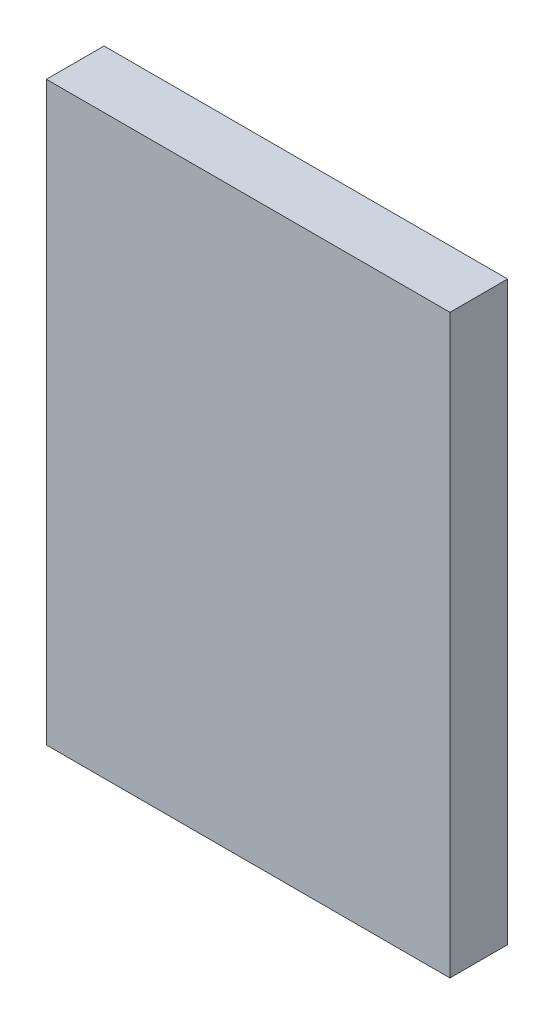
ISO-10303-21;
HEADER;
FILE_DESCRIPTION(('STEP AP214'),'2;1');
FILE_NAME('part.step','',(''),(''),'','','');
FILE_SCHEMA(('AUTOMOTIVE_DESIGN { 1 0 10303 214 1 1 1 1 }'));
ENDSEC;
DATA;
#1=APPLICATION_CONTEXT('core data for automotive mechanical design processes');
#2=APPLICATION_PROTOCOL_DEFINITION('international standard','automotive_design',2000,#1);
#3=PRODUCT_CONTEXT('',#1,'mechanical');
#4=PRODUCT('Part','Part','',(#3));
#5=PRODUCT_RELATED_PRODUCT_CATEGORY('part','',(#4));
#6=PRODUCT_DEFINITION_FORMATION('','',#4);
#7=PRODUCT_DEFINITION_CONTEXT('part definition',#1,'design');
#8=PRODUCT_DEFINITION('design','',#6,#7);
#9=PRODUCT_DEFINITION_SHAPE('','',#8);
#10=(LENGTH_UNIT() NAMED_UNIT(*) SI_UNIT(.MILLI.,.METRE.));
#11=(NAMED_UNIT(*) PLANE_ANGLE_UNIT() SI_UNIT($,.RADIAN.));
#12=(NAMED_UNIT(*) SI_UNIT($,.STERADIAN.) SOLID_ANGLE_UNIT());
#13=UNCERTAINTY_MEASURE_WITH_UNIT(LENGTH_MEASURE(1.E-05),#10,'distance_accuracy_value','');
#14=(GEOMETRIC_REPRESENTATION_CONTEXT(3) GLOBAL_UNCERTAINTY_ASSIGNED_CONTEXT((#13)) GLOBAL_UNIT_ASSIGNED_CONTEXT((#10,
#11,#12)) REPRESENTATION_CONTEXT('',''));
#15=CARTESIAN_POINT('',(0.,0.,0.));
#16=DIRECTION('',(0.,0.,1.));
#17=DIRECTION('',(1.,0.,0.));
#18=AXIS2_PLACEMENT_3D('',#15,#16,#17);
#19=CARTESIAN_POINT('',(-175.,-250.,25.));
#20=DIRECTION('',(1.,0.,0.));
#21=DIRECTION('',(0.,0.,-1.));
#22=AXIS2_PLACEMENT_3D('',#19,#20,#21);
#23=PLANE('',#22);
#24=DIRECTION('',(0.,-1.,0.));
#25=VECTOR('',#24,1.);
#26=CARTESIAN_POINT('',(-175.,-250.,-25.));
#27=LINE('',#26,#25);
#28=CARTESIAN_POINT('',(-175.,250.,-25.));
#29=VERTEX_POINT('',#28);
#30=CARTESIAN_POINT('',(-175.,-250.,-25.));
#31=VERTEX_POINT('',#30);
#32=EDGE_CURVE('E96',#29,#31,#27,.T.);
#33=ORIENTED_EDGE('',*,*,#32,.T.);
#34=DIRECTION('',(0.,0.,-1.));
#35=VECTOR('',#34,1.);
#36=CARTESIAN_POINT('',(-175.,-250.,25.));
#37=LINE('',#36,#35);
#38=CARTESIAN_POINT('',(-175.,-250.,25.));
#39=VERTEX_POINT('',#38);
#40=EDGE_CURVE('E11',#39,#31,#37,.T.);
#41=ORIENTED_EDGE('',*,*,#40,.F.);
#42=DIRECTION('',(0.,-1.,0.));
#43=VECTOR('',#42,1.);
#44=CARTESIAN_POINT('',(-175.,-250.,25.));
#45=LINE('',#44,#43);
#46=CARTESIAN_POINT('',(-175.,250.,25.));
#47=VERTEX_POINT('',#46);
#48=EDGE_CURVE('E84',#47,#39,#45,.T.);
#49=ORIENTED_EDGE('',*,*,#48,.F.);
#50=DIRECTION('',(0.,0.,-1.));
#51=VECTOR('',#50,1.);
#52=CARTESIAN_POINT('',(-175.,250.,25.));
#53=LINE('',#52,#51);
#54=EDGE_CURVE('E92',#47,#29,#53,.T.);
#55=ORIENTED_EDGE('',*,*,#54,.T.);
#56=EDGE_LOOP('',(#33,#41,#49,#55));
#57=FACE_BOUND('',#56,.T.);
#58=ADVANCED_FACE('F33',(#57),#23,.F.);
#59=CARTESIAN_POINT('',(175.,-250.,25.));
#60=DIRECTION('',(0.,1.,0.));
#61=DIRECTION('',(-1.,0.,0.));
#62=AXIS2_PLACEMENT_3D('',#59,#60,#61);
#63=PLANE('',#62);
#64=DIRECTION('',(1.,0.,0.));
#65=VECTOR('',#64,1.);
#66=CARTESIAN_POINT('',(175.,-250.,-25.));
#67=LINE('',#66,#65);
#68=CARTESIAN_POINT('',(175.,-250.,-25.));
#69=VERTEX_POINT('',#68);
#70=EDGE_CURVE('E88',#31,#69,#67,.T.);
#71=ORIENTED_EDGE('',*,*,#70,.T.);
#72=DIRECTION('',(0.,0.,-1.));
#73=VECTOR('',#72,1.);
#74=CARTESIAN_POINT('',(175.,-250.,25.));
#75=LINE('',#74,#73);
#76=CARTESIAN_POINT('',(175.,-250.,25.));
#77=VERTEX_POINT('',#76);
#78=EDGE_CURVE('E41',#77,#69,#75,.T.);
#79=ORIENTED_EDGE('',*,*,#78,.F.);
#80=DIRECTION('',(1.,0.,0.));
#81=VECTOR('',#80,1.);
#82=CARTESIAN_POINT('',(175.,-250.,25.));
#83=LINE('',#82,#81);
#84=EDGE_CURVE('E79',#39,#77,#83,.T.);
#85=ORIENTED_EDGE('',*,*,#84,.F.);
#86=ORIENTED_EDGE('',*,*,#40,.T.);
#87=EDGE_LOOP('',(#71,#79,#85,#86));
#88=FACE_BOUND('',#87,.T.);
#89=ADVANCED_FACE('F87',(#88),#63,.F.);
#90=CARTESIAN_POINT('',(175.,-250.,25.));
#91=DIRECTION('',(-1.,0.,0.));
#92=DIRECTION('',(0.,0.,1.));
#93=AXIS2_PLACEMENT_3D('',#90,#91,#92);
#94=PLANE('',#93);
#95=DIRECTION('',(0.,1.,0.));
#96=VECTOR('',#95,1.);
#97=CARTESIAN_POINT('',(175.,-250.,-25.));
#98=LINE('',#97,#96);
#99=CARTESIAN_POINT('',(175.,250.,-25.));
#100=VERTEX_POINT('',#99);
#101=EDGE_CURVE('E66',#69,#100,#98,.T.);
#102=ORIENTED_EDGE('',*,*,#101,.T.);
#103=DIRECTION('',(0.,0.,-1.));
#104=VECTOR('',#103,1.);
#105=CARTESIAN_POINT('',(175.,250.,25.));
#106=LINE('',#105,#104);
#107=CARTESIAN_POINT('',(175.,250.,25.));
#108=VERTEX_POINT('',#107);
#109=EDGE_CURVE('E89',#108,#100,#106,.T.);
#110=ORIENTED_EDGE('',*,*,#109,.F.);
#111=DIRECTION('',(0.,1.,0.));
#112=VECTOR('',#111,1.);
#113=CARTESIAN_POINT('',(175.,-250.,25.));
#114=LINE('',#113,#112);
#115=EDGE_CURVE('E82',#77,#108,#114,.T.);
#116=ORIENTED_EDGE('',*,*,#115,.F.);
#117=ORIENTED_EDGE('',*,*,#78,.T.);
#118=EDGE_LOOP('',(#102,#110,#116,#117));
#119=FACE_BOUND('',#118,.T.);
#120=ADVANCED_FACE('F90',(#119),#94,.F.);
#121=CARTESIAN_POINT('',(175.,250.,25.));
#122=DIRECTION('',(0.,-1.,0.));
#123=DIRECTION('',(0.,0.,-1.));
#124=AXIS2_PLACEMENT_3D('',#121,#122,#123);
#125=PLANE('',#124);
#126=DIRECTION('',(-1.,0.,0.));
#127=VECTOR('',#126,1.);
#128=CARTESIAN_POINT('',(175.,250.,-25.));
#129=LINE('',#128,#127);
#130=EDGE_CURVE('E72',#100,#29,#129,.T.);
#131=ORIENTED_EDGE('',*,*,#130,.T.);
#132=ORIENTED_EDGE('',*,*,#54,.F.);
#133=DIRECTION('',(-1.,0.,0.));
#134=VECTOR('',#133,1.);
#135=CARTESIAN_POINT('',(175.,250.,25.));
#136=LINE('',#135,#134);
#137=EDGE_CURVE('E49',#108,#47,#136,.T.);
#138=ORIENTED_EDGE('',*,*,#137,.F.);
#139=ORIENTED_EDGE('',*,*,#109,.T.);
#140=EDGE_LOOP('',(#131,#132,#138,#139));
#141=FACE_BOUND('',#140,.T.);
#142=ADVANCED_FACE('F103',(#141),#125,.F.);
#143=CARTESIAN_POINT('',(0.,0.,25.));
#144=DIRECTION('',(0.,0.,1.));
#145=DIRECTION('',(1.,0.,0.));
#146=AXIS2_PLACEMENT_3D('',#143,#144,#145);
#147=PLANE('',#146);
#148=ORIENTED_EDGE('',*,*,#48,.T.);
#149=ORIENTED_EDGE('',*,*,#84,.T.);
#150=ORIENTED_EDGE('',*,*,#115,.T.);
#151=ORIENTED_EDGE('',*,*,#137,.T.);
#152=EDGE_LOOP('',(#148,#149,#150,#151));
#153=FACE_BOUND('',#152,.T.);
#154=ADVANCED_FACE('F80',(#153),#147,.T.);
#155=CARTESIAN_POINT('',(0.,0.,-25.));
#156=DIRECTION('',(0.,0.,1.));
#157=DIRECTION('',(1.,0.,0.));
#158=AXIS2_PLACEMENT_3D('',#155,#156,#157);
#159=PLANE('',#158);
#160=ORIENTED_EDGE('',*,*,#32,.F.);
#161=ORIENTED_EDGE('',*,*,#130,.F.);
#162=ORIENTED_EDGE('',*,*,#101,.F.);
#163=ORIENTED_EDGE('',*,*,#70,.F.);
#164=EDGE_LOOP('',(#160,#161,#162,#163));
#165=FACE_BOUND('',#164,.T.);
#166=ADVANCED_FACE('F106',(#165),#159,.F.);
#167=CLOSED_SHELL('',(#58,#89,#120,#142,#154,#166));
#168=MANIFOLD_SOLID_BREP('B2',#167);
#169=ADVANCED_BREP_SHAPE_REPRESENTATION('',(#18,#168),#14);
#170=SHAPE_DEFINITION_REPRESENTATION(#9,#169);
ENDSEC;
END-ISO-10303-21;
